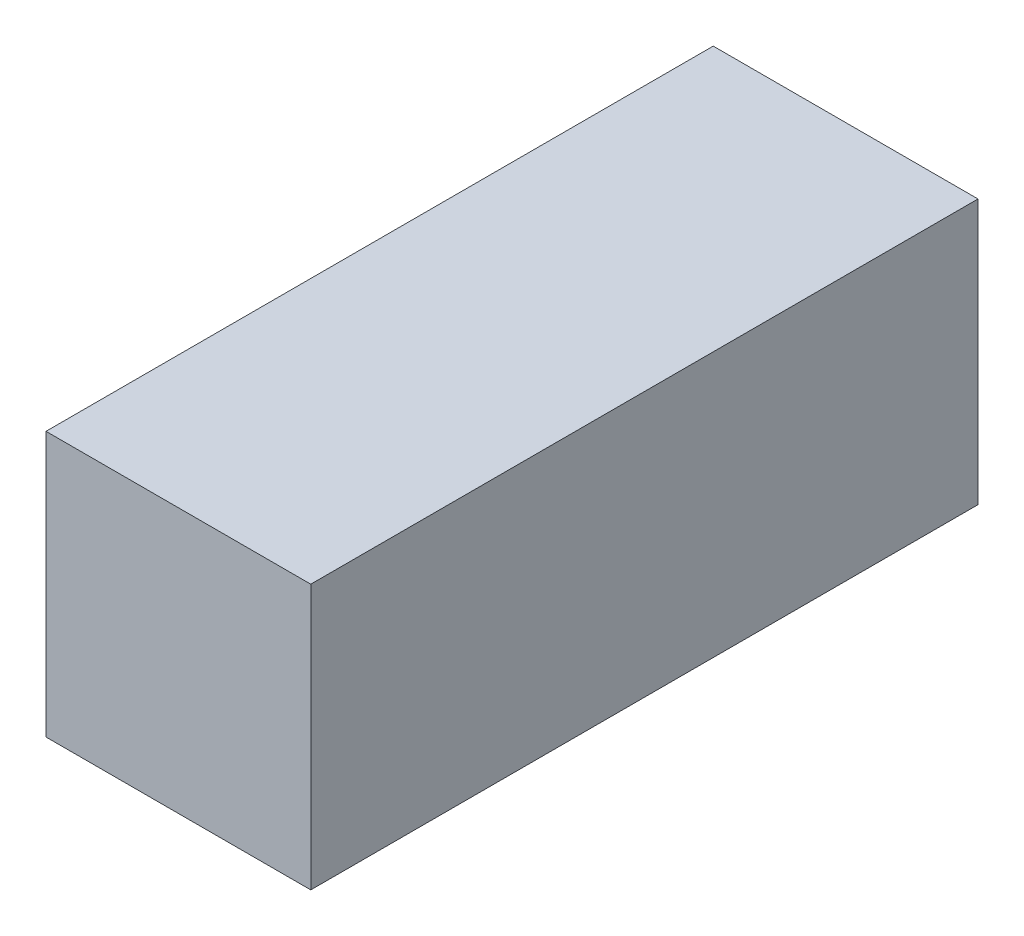
ISO-10303-21;
HEADER;
FILE_DESCRIPTION(('STEP AP214'),'2;1');
FILE_NAME('part.step','',(''),(''),'','','');
FILE_SCHEMA(('AUTOMOTIVE_DESIGN { 1 0 10303 214 1 1 1 1 }'));
ENDSEC;
DATA;
#1=APPLICATION_CONTEXT('core data for automotive mechanical design processes');
#2=APPLICATION_PROTOCOL_DEFINITION('international standard','automotive_design',2000,#1);
#3=PRODUCT_CONTEXT('',#1,'mechanical');
#4=PRODUCT('Part','Part','',(#3));
#5=PRODUCT_RELATED_PRODUCT_CATEGORY('part','',(#4));
#6=PRODUCT_DEFINITION_FORMATION('','',#4);
#7=PRODUCT_DEFINITION_CONTEXT('part definition',#1,'design');
#8=PRODUCT_DEFINITION('design','',#6,#7);
#9=PRODUCT_DEFINITION_SHAPE('','',#8);
#10=(LENGTH_UNIT() NAMED_UNIT(*) SI_UNIT(.MILLI.,.METRE.));
#11=(NAMED_UNIT(*) PLANE_ANGLE_UNIT() SI_UNIT($,.RADIAN.));
#12=(NAMED_UNIT(*) SI_UNIT($,.STERADIAN.) SOLID_ANGLE_UNIT());
#13=UNCERTAINTY_MEASURE_WITH_UNIT(LENGTH_MEASURE(1.E-05),#10,'distance_accuracy_value','');
#14=(GEOMETRIC_REPRESENTATION_CONTEXT(3) GLOBAL_UNCERTAINTY_ASSIGNED_CONTEXT((#13)) GLOBAL_UNIT_ASSIGNED_CONTEXT((#10,
#11,#12)) REPRESENTATION_CONTEXT('',''));
#15=CARTESIAN_POINT('',(0.,0.,0.));
#16=DIRECTION('',(0.,0.,1.));
#17=DIRECTION('',(1.,0.,0.));
#18=AXIS2_PLACEMENT_3D('',#15,#16,#17);
#19=CARTESIAN_POINT('',(0.,0.,63.));
#20=DIRECTION('',(1.,0.,0.));
#21=DIRECTION('',(0.,1.,0.));
#22=AXIS2_PLACEMENT_3D('',#19,#20,#21);
#23=PLANE('',#22);
#24=DIRECTION('',(0.,-1.,0.));
#25=VECTOR('',#24,1.);
#26=CARTESIAN_POINT('',(0.,0.,0.));
#27=LINE('',#26,#25);
#28=CARTESIAN_POINT('',(0.,0.,0.));
#29=VERTEX_POINT('',#28);
#30=CARTESIAN_POINT('',(0.,-25.,0.));
#31=VERTEX_POINT('',#30);
#32=EDGE_CURVE('E103',#29,#31,#27,.T.);
#33=ORIENTED_EDGE('',*,*,#32,.T.);
#34=DIRECTION('',(0.,0.,-1.));
#35=VECTOR('',#34,1.);
#36=CARTESIAN_POINT('',(0.,-25.,63.));
#37=LINE('',#36,#35);
#38=CARTESIAN_POINT('',(0.,-25.,63.));
#39=VERTEX_POINT('',#38);
#40=EDGE_CURVE('E11',#39,#31,#37,.T.);
#41=ORIENTED_EDGE('',*,*,#40,.F.);
#42=DIRECTION('',(0.,-1.,0.));
#43=VECTOR('',#42,1.);
#44=CARTESIAN_POINT('',(0.,0.,63.));
#45=LINE('',#44,#43);
#46=CARTESIAN_POINT('',(0.,0.,63.));
#47=VERTEX_POINT('',#46);
#48=EDGE_CURVE('E91',#47,#39,#45,.T.);
#49=ORIENTED_EDGE('',*,*,#48,.F.);
#50=DIRECTION('',(0.,0.,-1.));
#51=VECTOR('',#50,1.);
#52=CARTESIAN_POINT('',(0.,0.,63.));
#53=LINE('',#52,#51);
#54=EDGE_CURVE('E99',#47,#29,#53,.T.);
#55=ORIENTED_EDGE('',*,*,#54,.T.);
#56=EDGE_LOOP('',(#33,#41,#49,#55));
#57=FACE_BOUND('',#56,.T.);
#58=ADVANCED_FACE('F40',(#57),#23,.F.);
#59=CARTESIAN_POINT('',(0.,-25.,63.));
#60=DIRECTION('',(0.,1.,0.));
#61=DIRECTION('',(0.,0.,1.));
#62=AXIS2_PLACEMENT_3D('',#59,#60,#61);
#63=PLANE('',#62);
#64=DIRECTION('',(1.,0.,0.));
#65=VECTOR('',#64,1.);
#66=CARTESIAN_POINT('',(0.,-25.,0.));
#67=LINE('',#66,#65);
#68=CARTESIAN_POINT('',(25.,-25.,0.));
#69=VERTEX_POINT('',#68);
#70=EDGE_CURVE('E95',#31,#69,#67,.T.);
#71=ORIENTED_EDGE('',*,*,#70,.T.);
#72=DIRECTION('',(0.,0.,-1.));
#73=VECTOR('',#72,1.);
#74=CARTESIAN_POINT('',(25.,-25.,63.));
#75=LINE('',#74,#73);
#76=CARTESIAN_POINT('',(25.,-25.,63.));
#77=VERTEX_POINT('',#76);
#78=EDGE_CURVE('E48',#77,#69,#75,.T.);
#79=ORIENTED_EDGE('',*,*,#78,.F.);
#80=DIRECTION('',(1.,0.,0.));
#81=VECTOR('',#80,1.);
#82=CARTESIAN_POINT('',(0.,-25.,63.));
#83=LINE('',#82,#81);
#84=EDGE_CURVE('E86',#39,#77,#83,.T.);
#85=ORIENTED_EDGE('',*,*,#84,.F.);
#86=ORIENTED_EDGE('',*,*,#40,.T.);
#87=EDGE_LOOP('',(#71,#79,#85,#86));
#88=FACE_BOUND('',#87,.T.);
#89=ADVANCED_FACE('F94',(#88),#63,.F.);
#90=CARTESIAN_POINT('',(25.,0.,63.));
#91=DIRECTION('',(-1.,0.,0.));
#92=DIRECTION('',(0.,-1.,0.));
#93=AXIS2_PLACEMENT_3D('',#90,#91,#92);
#94=PLANE('',#93);
#95=DIRECTION('',(0.,1.,0.));
#96=VECTOR('',#95,1.);
#97=CARTESIAN_POINT('',(25.,0.,0.));
#98=LINE('',#97,#96);
#99=CARTESIAN_POINT('',(25.,0.,0.));
#100=VERTEX_POINT('',#99);
#101=EDGE_CURVE('E73',#69,#100,#98,.T.);
#102=ORIENTED_EDGE('',*,*,#101,.T.);
#103=DIRECTION('',(0.,0.,-1.));
#104=VECTOR('',#103,1.);
#105=CARTESIAN_POINT('',(25.,0.,63.));
#106=LINE('',#105,#104);
#107=CARTESIAN_POINT('',(25.,0.,63.));
#108=VERTEX_POINT('',#107);
#109=EDGE_CURVE('E96',#108,#100,#106,.T.);
#110=ORIENTED_EDGE('',*,*,#109,.F.);
#111=DIRECTION('',(0.,1.,0.));
#112=VECTOR('',#111,1.);
#113=CARTESIAN_POINT('',(25.,0.,63.));
#114=LINE('',#113,#112);
#115=EDGE_CURVE('E89',#77,#108,#114,.T.);
#116=ORIENTED_EDGE('',*,*,#115,.F.);
#117=ORIENTED_EDGE('',*,*,#78,.T.);
#118=EDGE_LOOP('',(#102,#110,#116,#117));
#119=FACE_BOUND('',#118,.T.);
#120=ADVANCED_FACE('F97',(#119),#94,.F.);
#121=CARTESIAN_POINT('',(0.,0.,63.));
#122=DIRECTION('',(0.,-1.,0.));
#123=DIRECTION('',(0.,0.,-1.));
#124=AXIS2_PLACEMENT_3D('',#121,#122,#123);
#125=PLANE('',#124);
#126=DIRECTION('',(-1.,0.,0.));
#127=VECTOR('',#126,1.);
#128=CARTESIAN_POINT('',(0.,0.,0.));
#129=LINE('',#128,#127);
#130=EDGE_CURVE('E79',#100,#29,#129,.T.);
#131=ORIENTED_EDGE('',*,*,#130,.T.);
#132=ORIENTED_EDGE('',*,*,#54,.F.);
#133=DIRECTION('',(-1.,0.,0.));
#134=VECTOR('',#133,1.);
#135=CARTESIAN_POINT('',(0.,0.,63.));
#136=LINE('',#135,#134);
#137=EDGE_CURVE('E56',#108,#47,#136,.T.);
#138=ORIENTED_EDGE('',*,*,#137,.F.);
#139=ORIENTED_EDGE('',*,*,#109,.T.);
#140=EDGE_LOOP('',(#131,#132,#138,#139));
#141=FACE_BOUND('',#140,.T.);
#142=ADVANCED_FACE('F110',(#141),#125,.F.);
#143=CARTESIAN_POINT('',(0.,0.,63.));
#144=DIRECTION('',(0.,0.,1.));
#145=DIRECTION('',(1.,0.,0.));
#146=AXIS2_PLACEMENT_3D('',#143,#144,#145);
#147=PLANE('',#146);
#148=ORIENTED_EDGE('',*,*,#48,.T.);
#149=ORIENTED_EDGE('',*,*,#84,.T.);
#150=ORIENTED_EDGE('',*,*,#115,.T.);
#151=ORIENTED_EDGE('',*,*,#137,.T.);
#152=EDGE_LOOP('',(#148,#149,#150,#151));
#153=FACE_BOUND('',#152,.T.);
#154=ADVANCED_FACE('F87',(#153),#147,.T.);
#155=CARTESIAN_POINT('',(0.,0.,0.));
#156=DIRECTION('',(0.,0.,1.));
#157=DIRECTION('',(1.,0.,0.));
#158=AXIS2_PLACEMENT_3D('',#155,#156,#157);
#159=PLANE('',#158);
#160=ORIENTED_EDGE('',*,*,#32,.F.);
#161=ORIENTED_EDGE('',*,*,#130,.F.);
#162=ORIENTED_EDGE('',*,*,#101,.F.);
#163=ORIENTED_EDGE('',*,*,#70,.F.);
#164=EDGE_LOOP('',(#160,#161,#162,#163));
#165=FACE_BOUND('',#164,.T.);
#166=ADVANCED_FACE('F113',(#165),#159,.F.);
#167=CLOSED_SHELL('',(#58,#89,#120,#142,#154,#166));
#168=MANIFOLD_SOLID_BREP('B2',#167);
#169=ADVANCED_BREP_SHAPE_REPRESENTATION('',(#18,#168),#14);
#170=SHAPE_DEFINITION_REPRESENTATION(#9,#169);
ENDSEC;
END-ISO-10303-21;
